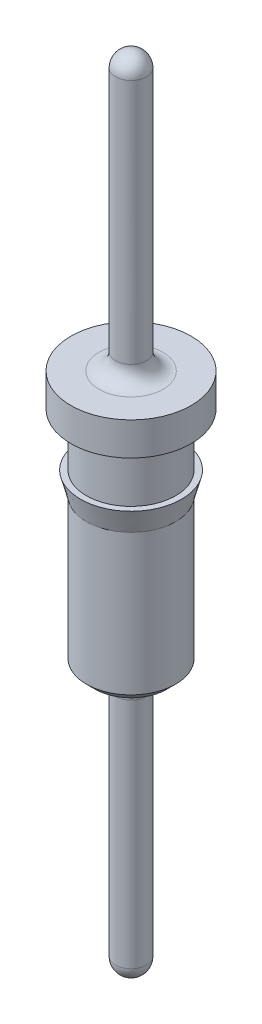
ISO-10303-21;
HEADER;
FILE_DESCRIPTION(('STEP AP214'),'2;1');
FILE_NAME('part.step','',(''),(''),'','','');
FILE_SCHEMA(('AUTOMOTIVE_DESIGN { 1 0 10303 214 1 1 1 1 }'));
ENDSEC;
DATA;
#1=APPLICATION_CONTEXT('core data for automotive mechanical design processes');
#2=APPLICATION_PROTOCOL_DEFINITION('international standard','automotive_design',2000,#1);
#3=PRODUCT_CONTEXT('',#1,'mechanical');
#4=PRODUCT('Part','Part','',(#3));
#5=PRODUCT_RELATED_PRODUCT_CATEGORY('part','',(#4));
#6=PRODUCT_DEFINITION_FORMATION('','',#4);
#7=PRODUCT_DEFINITION_CONTEXT('part definition',#1,'design');
#8=PRODUCT_DEFINITION('design','',#6,#7);
#9=PRODUCT_DEFINITION_SHAPE('','',#8);
#10=(LENGTH_UNIT() NAMED_UNIT(*) SI_UNIT(.MILLI.,.METRE.));
#11=(NAMED_UNIT(*) PLANE_ANGLE_UNIT() SI_UNIT($,.RADIAN.));
#12=(NAMED_UNIT(*) SI_UNIT($,.STERADIAN.) SOLID_ANGLE_UNIT());
#13=UNCERTAINTY_MEASURE_WITH_UNIT(LENGTH_MEASURE(1.E-05),#10,'distance_accuracy_value','');
#14=(GEOMETRIC_REPRESENTATION_CONTEXT(3) GLOBAL_UNCERTAINTY_ASSIGNED_CONTEXT((#13)) GLOBAL_UNIT_ASSIGNED_CONTEXT((#10,
#11,#12)) REPRESENTATION_CONTEXT('',''));
#15=CARTESIAN_POINT('',(0.,0.,0.));
#16=DIRECTION('',(0.,0.,1.));
#17=DIRECTION('',(1.,0.,0.));
#18=AXIS2_PLACEMENT_3D('',#15,#16,#17);
#19=CARTESIAN_POINT('',(0.,0.,0.));
#20=DIRECTION('',(0.,0.,1.));
#21=DIRECTION('',(1.,0.,0.));
#22=AXIS2_PLACEMENT_3D('',#19,#20,#21);
#23=SPHERICAL_SURFACE('',#22,0.235000000000001);
#24=CARTESIAN_POINT('',(0.,0.,0.));
#25=DIRECTION('',(0.,-1.,0.));
#26=DIRECTION('',(0.,0.,-1.));
#27=AXIS2_PLACEMENT_3D('',#24,#25,#26);
#28=SPHERICAL_SURFACE('',#27,0.235000000000001);
#29=CARTESIAN_POINT('',(0.,0.,0.));
#30=DIRECTION('',(0.,-1.,0.));
#31=DIRECTION('',(0.,0.,-1.));
#32=AXIS2_PLACEMENT_3D('',#29,#30,#31);
#33=CIRCLE('',#32,0.235000000000001);
#34=CARTESIAN_POINT('',(0.,0.,-0.235000000000001));
#35=VERTEX_POINT('',#34);
#36=EDGE_CURVE('E52',#35,#35,#33,.T.);
#37=ORIENTED_EDGE('',*,*,#36,.T.);
#38=EDGE_LOOP('',(#37));
#39=FACE_BOUND('',#38,.T.);
#40=ADVANCED_FACE('F31',(#39),#28,.T.);
#41=CARTESIAN_POINT('',(0.,11.64,0.));
#42=DIRECTION('',(0.,0.,1.));
#43=DIRECTION('',(1.,0.,0.));
#44=AXIS2_PLACEMENT_3D('',#41,#42,#43);
#45=SPHERICAL_SURFACE('',#44,0.234999999999999);
#46=CARTESIAN_POINT('',(0.,11.64,0.));
#47=DIRECTION('',(0.,-1.,0.));
#48=DIRECTION('',(0.,0.,-1.));
#49=AXIS2_PLACEMENT_3D('',#46,#47,#48);
#50=SPHERICAL_SURFACE('',#49,0.234999999999999);
#51=CARTESIAN_POINT('',(0.,11.64,0.));
#52=DIRECTION('',(0.,-1.,0.));
#53=DIRECTION('',(0.,0.,-1.));
#54=AXIS2_PLACEMENT_3D('',#51,#52,#53);
#55=CIRCLE('',#54,0.234999999999999);
#56=CARTESIAN_POINT('',(0.,11.64,-0.234999999999999));
#57=VERTEX_POINT('',#56);
#58=EDGE_CURVE('E51',#57,#57,#55,.T.);
#59=ORIENTED_EDGE('',*,*,#58,.F.);
#60=EDGE_LOOP('',(#59));
#61=FACE_BOUND('',#60,.T.);
#62=ADVANCED_FACE('F100',(#61),#50,.T.);
#63=CARTESIAN_POINT('',(0.,0.,0.));
#64=DIRECTION('',(0.,-1.,0.));
#65=DIRECTION('',(0.,0.,-1.));
#66=AXIS2_PLACEMENT_3D('',#63,#64,#65);
#67=CYLINDRICAL_SURFACE('',#66,0.234999999999999);
#68=CARTESIAN_POINT('',(0.,7.92,0.));
#69=DIRECTION('',(0.,1.,0.));
#70=DIRECTION('',(0.,0.,1.));
#71=AXIS2_PLACEMENT_3D('',#68,#69,#70);
#72=CIRCLE('',#71,0.234999999999999);
#73=CARTESIAN_POINT('',(0.,7.92,0.234999999999999));
#74=VERTEX_POINT('',#73);
#75=EDGE_CURVE('E10',#74,#74,#72,.T.);
#76=ORIENTED_EDGE('',*,*,#75,.T.);
#77=EDGE_LOOP('',(#76));
#78=FACE_BOUND('',#77,.T.);
#79=ORIENTED_EDGE('',*,*,#58,.T.);
#80=EDGE_LOOP('',(#79));
#81=FACE_BOUND('',#80,.T.);
#82=ADVANCED_FACE('F106',(#78,#81),#67,.T.);
#83=CARTESIAN_POINT('',(0.235,7.67,0.));
#84=DIRECTION('',(0.,1.,0.));
#85=DIRECTION('',(0.,0.,1.));
#86=AXIS2_PLACEMENT_3D('',#83,#84,#85);
#87=PLANE('',#86);
#88=CARTESIAN_POINT('',(0.,7.67,0.));
#89=DIRECTION('',(0.,1.,0.));
#90=DIRECTION('',(0.,0.,1.));
#91=AXIS2_PLACEMENT_3D('',#88,#89,#90);
#92=CIRCLE('',#91,0.484999999999999);
#93=CARTESIAN_POINT('',(0.,7.67,0.484999999999999));
#94=VERTEX_POINT('',#93);
#95=EDGE_CURVE('E38',#94,#94,#92,.F.);
#96=ORIENTED_EDGE('',*,*,#95,.T.);
#97=EDGE_LOOP('',(#96));
#98=FACE_BOUND('',#97,.T.);
#99=CARTESIAN_POINT('',(0.,7.67,0.));
#100=DIRECTION('',(0.,-1.,0.));
#101=DIRECTION('',(0.,0.,-1.));
#102=AXIS2_PLACEMENT_3D('',#99,#100,#101);
#103=CIRCLE('',#102,0.910000000000003);
#104=CARTESIAN_POINT('',(0.,7.67,-0.910000000000003));
#105=VERTEX_POINT('',#104);
#106=EDGE_CURVE('E58',#105,#105,#103,.T.);
#107=ORIENTED_EDGE('',*,*,#106,.F.);
#108=EDGE_LOOP('',(#107));
#109=FACE_BOUND('',#108,.T.);
#110=ADVANCED_FACE('F137',(#98,#109),#87,.T.);
#111=CARTESIAN_POINT('',(0.,0.,0.));
#112=DIRECTION('',(0.,-1.,0.));
#113=DIRECTION('',(0.,0.,-1.));
#114=AXIS2_PLACEMENT_3D('',#111,#112,#113);
#115=CYLINDRICAL_SURFACE('',#114,0.910000000000003);
#116=ORIENTED_EDGE('',*,*,#106,.T.);
#117=EDGE_LOOP('',(#116));
#118=FACE_BOUND('',#117,.T.);
#119=CARTESIAN_POINT('',(0.,7.17,0.));
#120=DIRECTION('',(0.,-1.,0.));
#121=DIRECTION('',(0.,0.,-1.));
#122=AXIS2_PLACEMENT_3D('',#119,#120,#121);
#123=CIRCLE('',#122,0.910000000000004);
#124=CARTESIAN_POINT('',(0.,7.17,-0.910000000000004));
#125=VERTEX_POINT('',#124);
#126=EDGE_CURVE('E61',#125,#125,#123,.T.);
#127=ORIENTED_EDGE('',*,*,#126,.F.);
#128=EDGE_LOOP('',(#127));
#129=FACE_BOUND('',#128,.T.);
#130=ADVANCED_FACE('F142',(#118,#129),#115,.T.);
#131=CARTESIAN_POINT('',(0.910000000000004,7.17,0.));
#132=DIRECTION('',(0.,-1.,0.));
#133=DIRECTION('',(0.,0.,-1.));
#134=AXIS2_PLACEMENT_3D('',#131,#132,#133);
#135=PLANE('',#134);
#136=ORIENTED_EDGE('',*,*,#126,.T.);
#137=EDGE_LOOP('',(#136));
#138=FACE_BOUND('',#137,.T.);
#139=CARTESIAN_POINT('',(0.,7.17,0.));
#140=DIRECTION('',(0.,-1.,0.));
#141=DIRECTION('',(0.,0.,-1.));
#142=AXIS2_PLACEMENT_3D('',#139,#140,#141);
#143=CIRCLE('',#142,0.675);
#144=CARTESIAN_POINT('',(0.,7.17,-0.675));
#145=VERTEX_POINT('',#144);
#146=EDGE_CURVE('E64',#145,#145,#143,.T.);
#147=ORIENTED_EDGE('',*,*,#146,.F.);
#148=EDGE_LOOP('',(#147));
#149=FACE_BOUND('',#148,.T.);
#150=ADVANCED_FACE('F200',(#138,#149),#135,.T.);
#151=CARTESIAN_POINT('',(0.,0.,0.));
#152=DIRECTION('',(0.,-1.,0.));
#153=DIRECTION('',(0.,0.,-1.));
#154=AXIS2_PLACEMENT_3D('',#151,#152,#153);
#155=CYLINDRICAL_SURFACE('',#154,0.675);
#156=ORIENTED_EDGE('',*,*,#146,.T.);
#157=EDGE_LOOP('',(#156));
#158=FACE_BOUND('',#157,.T.);
#159=CARTESIAN_POINT('',(0.,6.37,0.));
#160=DIRECTION('',(0.,-1.,0.));
#161=DIRECTION('',(0.,0.,-1.));
#162=AXIS2_PLACEMENT_3D('',#159,#160,#161);
#163=CIRCLE('',#162,0.675);
#164=CARTESIAN_POINT('',(0.,6.37,-0.675));
#165=VERTEX_POINT('',#164);
#166=EDGE_CURVE('E67',#165,#165,#163,.T.);
#167=ORIENTED_EDGE('',*,*,#166,.F.);
#168=EDGE_LOOP('',(#167));
#169=FACE_BOUND('',#168,.T.);
#170=ADVANCED_FACE('F190',(#158,#169),#155,.T.);
#171=CARTESIAN_POINT('',(0.675,6.37,0.));
#172=DIRECTION('',(0.,1.,0.));
#173=DIRECTION('',(0.,0.,1.));
#174=AXIS2_PLACEMENT_3D('',#171,#172,#173);
#175=PLANE('',#174);
#176=ORIENTED_EDGE('',*,*,#166,.T.);
#177=EDGE_LOOP('',(#176));
#178=FACE_BOUND('',#177,.T.);
#179=CARTESIAN_POINT('',(0.,6.37,0.));
#180=DIRECTION('',(0.,-1.,0.));
#181=DIRECTION('',(0.,0.,-1.));
#182=AXIS2_PLACEMENT_3D('',#179,#180,#181);
#183=CIRCLE('',#182,0.765);
#184=CARTESIAN_POINT('',(0.,6.37,-0.765));
#185=VERTEX_POINT('',#184);
#186=EDGE_CURVE('E70',#185,#185,#183,.T.);
#187=ORIENTED_EDGE('',*,*,#186,.F.);
#188=EDGE_LOOP('',(#187));
#189=FACE_BOUND('',#188,.T.);
#190=ADVANCED_FACE('F180',(#178,#189),#175,.T.);
#191=CARTESIAN_POINT('',(0.,6.03,0.));
#192=DIRECTION('',(0.,1.,0.));
#193=DIRECTION('',(0.,0.,1.));
#194=AXIS2_PLACEMENT_3D('',#191,#192,#193);
#195=CONICAL_SURFACE('',#194,0.675000000000002,0.258770891963693);
#196=ORIENTED_EDGE('',*,*,#186,.T.);
#197=EDGE_LOOP('',(#196));
#198=FACE_BOUND('',#197,.T.);
#199=CARTESIAN_POINT('',(0.,6.03,0.));
#200=DIRECTION('',(0.,-1.,0.));
#201=DIRECTION('',(0.,0.,-1.));
#202=AXIS2_PLACEMENT_3D('',#199,#200,#201);
#203=CIRCLE('',#202,0.675000000000002);
#204=CARTESIAN_POINT('',(0.,6.03,-0.675000000000002));
#205=VERTEX_POINT('',#204);
#206=EDGE_CURVE('E73',#205,#205,#203,.T.);
#207=ORIENTED_EDGE('',*,*,#206,.F.);
#208=EDGE_LOOP('',(#207));
#209=FACE_BOUND('',#208,.T.);
#210=ADVANCED_FACE('F96',(#198,#209),#195,.T.);
#211=CARTESIAN_POINT('',(0.,0.,0.));
#212=DIRECTION('',(0.,-1.,0.));
#213=DIRECTION('',(0.,0.,-1.));
#214=AXIS2_PLACEMENT_3D('',#211,#212,#213);
#215=CYLINDRICAL_SURFACE('',#214,0.675000000000002);
#216=ORIENTED_EDGE('',*,*,#206,.T.);
#217=EDGE_LOOP('',(#216));
#218=FACE_BOUND('',#217,.T.);
#219=CARTESIAN_POINT('',(0.,3.9,0.));
#220=DIRECTION('',(0.,-1.,0.));
#221=DIRECTION('',(0.,0.,-1.));
#222=AXIS2_PLACEMENT_3D('',#219,#220,#221);
#223=CIRCLE('',#222,0.675000000000002);
#224=CARTESIAN_POINT('',(0.,3.9,-0.675000000000002));
#225=VERTEX_POINT('',#224);
#226=EDGE_CURVE('E76',#225,#225,#223,.T.);
#227=ORIENTED_EDGE('',*,*,#226,.F.);
#228=EDGE_LOOP('',(#227));
#229=FACE_BOUND('',#228,.T.);
#230=ADVANCED_FACE('F86',(#218,#229),#215,.T.);
#231=CARTESIAN_POINT('',(0.,3.77,0.));
#232=DIRECTION('',(0.,1.,0.));
#233=DIRECTION('',(0.,0.,1.));
#234=AXIS2_PLACEMENT_3D('',#231,#232,#233);
#235=CONICAL_SURFACE('',#234,0.545,0.785398163397452);
#236=ORIENTED_EDGE('',*,*,#226,.T.);
#237=EDGE_LOOP('',(#236));
#238=FACE_BOUND('',#237,.T.);
#239=CARTESIAN_POINT('',(0.,3.77,0.));
#240=DIRECTION('',(0.,-1.,0.));
#241=DIRECTION('',(0.,0.,-1.));
#242=AXIS2_PLACEMENT_3D('',#239,#240,#241);
#243=CIRCLE('',#242,0.545);
#244=CARTESIAN_POINT('',(0.,3.77,-0.545));
#245=VERTEX_POINT('',#244);
#246=EDGE_CURVE('E55',#245,#245,#243,.T.);
#247=ORIENTED_EDGE('',*,*,#246,.F.);
#248=EDGE_LOOP('',(#247));
#249=FACE_BOUND('',#248,.T.);
#250=ADVANCED_FACE('F84',(#238,#249),#235,.T.);
#251=CARTESIAN_POINT('',(0.545,3.77,0.));
#252=DIRECTION('',(0.,-1.,0.));
#253=DIRECTION('',(0.,0.,-1.));
#254=AXIS2_PLACEMENT_3D('',#251,#252,#253);
#255=PLANE('',#254);
#256=CARTESIAN_POINT('',(0.,3.77,0.));
#257=DIRECTION('',(0.,-1.,0.));
#258=DIRECTION('',(0.,0.,-1.));
#259=AXIS2_PLACEMENT_3D('',#256,#257,#258);
#260=CIRCLE('',#259,0.485000000000001);
#261=CARTESIAN_POINT('',(0.,3.77,-0.485000000000001));
#262=VERTEX_POINT('',#261);
#263=EDGE_CURVE('E42',#262,#262,#260,.F.);
#264=ORIENTED_EDGE('',*,*,#263,.T.);
#265=EDGE_LOOP('',(#264));
#266=FACE_BOUND('',#265,.T.);
#267=ORIENTED_EDGE('',*,*,#246,.T.);
#268=EDGE_LOOP('',(#267));
#269=FACE_BOUND('',#268,.T.);
#270=ADVANCED_FACE('F82',(#266,#269),#255,.T.);
#271=CARTESIAN_POINT('',(0.,0.,0.));
#272=DIRECTION('',(0.,-1.,0.));
#273=DIRECTION('',(0.,0.,-1.));
#274=AXIS2_PLACEMENT_3D('',#271,#272,#273);
#275=CYLINDRICAL_SURFACE('',#274,0.235000000000001);
#276=CARTESIAN_POINT('',(0.,3.52,0.));
#277=DIRECTION('',(0.,-1.,0.));
#278=DIRECTION('',(0.,0.,-1.));
#279=AXIS2_PLACEMENT_3D('',#276,#277,#278);
#280=CIRCLE('',#279,0.235000000000001);
#281=CARTESIAN_POINT('',(0.,3.52,-0.235000000000001));
#282=VERTEX_POINT('',#281);
#283=EDGE_CURVE('E46',#282,#282,#280,.T.);
#284=ORIENTED_EDGE('',*,*,#283,.T.);
#285=EDGE_LOOP('',(#284));
#286=FACE_BOUND('',#285,.T.);
#287=ORIENTED_EDGE('',*,*,#36,.F.);
#288=EDGE_LOOP('',(#287));
#289=FACE_BOUND('',#288,.T.);
#290=ADVANCED_FACE('F93',(#286,#289),#275,.T.);
#291=CARTESIAN_POINT('',(0.,3.52,0.));
#292=DIRECTION('',(0.,-1.,0.));
#293=DIRECTION('',(0.,0.,-1.));
#294=AXIS2_PLACEMENT_3D('',#291,#292,#293);
#295=TOROIDAL_SURFACE('',#294,0.485000000000001,0.25);
#296=ORIENTED_EDGE('',*,*,#263,.F.);
#297=EDGE_LOOP('',(#296));
#298=FACE_BOUND('',#297,.T.);
#299=ORIENTED_EDGE('',*,*,#283,.F.);
#300=EDGE_LOOP('',(#299));
#301=FACE_BOUND('',#300,.T.);
#302=ADVANCED_FACE('F110',(#298,#301),#295,.F.);
#303=CARTESIAN_POINT('',(0.,7.92,0.));
#304=DIRECTION('',(0.,1.,0.));
#305=DIRECTION('',(0.,0.,1.));
#306=AXIS2_PLACEMENT_3D('',#303,#304,#305);
#307=TOROIDAL_SURFACE('',#306,0.484999999999999,0.25);
#308=ORIENTED_EDGE('',*,*,#75,.F.);
#309=EDGE_LOOP('',(#308));
#310=FACE_BOUND('',#309,.T.);
#311=ORIENTED_EDGE('',*,*,#95,.F.);
#312=EDGE_LOOP('',(#311));
#313=FACE_BOUND('',#312,.T.);
#314=ADVANCED_FACE('F33',(#310,#313),#307,.F.);
#315=CLOSED_SHELL('',(#40,#62,#82,#110,#130,#150,#170,#190,#210,#230,#250,#270,#290,#302,#314));
#316=MANIFOLD_SOLID_BREP('B2',#315);
#317=ADVANCED_BREP_SHAPE_REPRESENTATION('',(#18,#316),#14);
#318=SHAPE_DEFINITION_REPRESENTATION(#9,#317);
ENDSEC;
END-ISO-10303-21;
